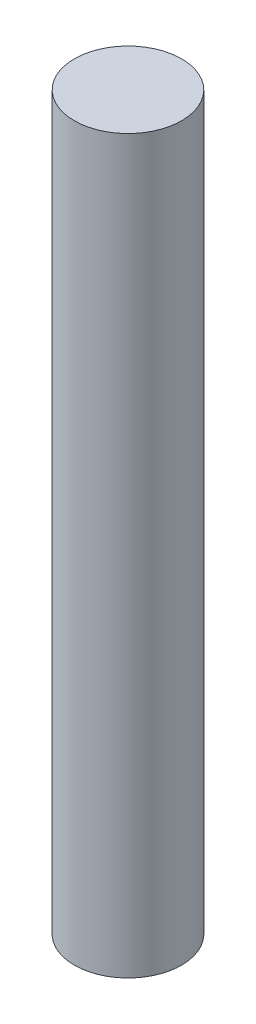
ISO-10303-21;
HEADER;
FILE_DESCRIPTION(('STEP AP214'),'2;1');
FILE_NAME('part.step','',(''),(''),'','','');
FILE_SCHEMA(('AUTOMOTIVE_DESIGN { 1 0 10303 214 1 1 1 1 }'));
ENDSEC;
DATA;
#1=APPLICATION_CONTEXT('core data for automotive mechanical design processes');
#2=APPLICATION_PROTOCOL_DEFINITION('international standard','automotive_design',2000,#1);
#3=PRODUCT_CONTEXT('',#1,'mechanical');
#4=PRODUCT('Part','Part','',(#3));
#5=PRODUCT_RELATED_PRODUCT_CATEGORY('part','',(#4));
#6=PRODUCT_DEFINITION_FORMATION('','',#4);
#7=PRODUCT_DEFINITION_CONTEXT('part definition',#1,'design');
#8=PRODUCT_DEFINITION('design','',#6,#7);
#9=PRODUCT_DEFINITION_SHAPE('','',#8);
#10=(LENGTH_UNIT() NAMED_UNIT(*) SI_UNIT(.MILLI.,.METRE.));
#11=(NAMED_UNIT(*) PLANE_ANGLE_UNIT() SI_UNIT($,.RADIAN.));
#12=(NAMED_UNIT(*) SI_UNIT($,.STERADIAN.) SOLID_ANGLE_UNIT());
#13=UNCERTAINTY_MEASURE_WITH_UNIT(LENGTH_MEASURE(1.E-05),#10,'distance_accuracy_value','');
#14=(GEOMETRIC_REPRESENTATION_CONTEXT(3) GLOBAL_UNCERTAINTY_ASSIGNED_CONTEXT((#13)) GLOBAL_UNIT_ASSIGNED_CONTEXT((#10,
#11,#12)) REPRESENTATION_CONTEXT('',''));
#15=CARTESIAN_POINT('',(0.,0.,0.));
#16=DIRECTION('',(0.,0.,1.));
#17=DIRECTION('',(1.,0.,0.));
#18=AXIS2_PLACEMENT_3D('',#15,#16,#17);
#19=CARTESIAN_POINT('',(0.,15.,0.));
#20=DIRECTION('',(0.,-1.,0.));
#21=DIRECTION('',(0.,0.,-1.));
#22=AXIS2_PLACEMENT_3D('',#19,#20,#21);
#23=CYLINDRICAL_SURFACE('',#22,1.1);
#24=CARTESIAN_POINT('',(0.,15.,0.));
#25=DIRECTION('',(0.,1.,0.));
#26=DIRECTION('',(0.,0.,1.));
#27=AXIS2_PLACEMENT_3D('',#24,#25,#26);
#28=CIRCLE('',#27,1.1);
#29=CARTESIAN_POINT('',(0.,15.,1.1));
#30=VERTEX_POINT('',#29);
#31=EDGE_CURVE('E10',#30,#30,#28,.T.);
#32=ORIENTED_EDGE('',*,*,#31,.F.);
#33=EDGE_LOOP('',(#32));
#34=FACE_BOUND('',#33,.T.);
#35=CARTESIAN_POINT('',(0.,0.,0.));
#36=DIRECTION('',(0.,1.,0.));
#37=DIRECTION('',(0.,0.,1.));
#38=AXIS2_PLACEMENT_3D('',#35,#36,#37);
#39=CIRCLE('',#38,1.1);
#40=CARTESIAN_POINT('',(0.,0.,1.1));
#41=VERTEX_POINT('',#40);
#42=EDGE_CURVE('E34',#41,#41,#39,.T.);
#43=ORIENTED_EDGE('',*,*,#42,.T.);
#44=EDGE_LOOP('',(#43));
#45=FACE_BOUND('',#44,.T.);
#46=ADVANCED_FACE('F31',(#34,#45),#23,.T.);
#47=CARTESIAN_POINT('',(0.,15.,0.));
#48=DIRECTION('',(0.,1.,0.));
#49=DIRECTION('',(0.,0.,1.));
#50=AXIS2_PLACEMENT_3D('',#47,#48,#49);
#51=PLANE('',#50);
#52=ORIENTED_EDGE('',*,*,#31,.T.);
#53=EDGE_LOOP('',(#52));
#54=FACE_BOUND('',#53,.T.);
#55=ADVANCED_FACE('F46',(#54),#51,.T.);
#56=CARTESIAN_POINT('',(0.,0.,0.));
#57=DIRECTION('',(0.,1.,0.));
#58=DIRECTION('',(0.,0.,1.));
#59=AXIS2_PLACEMENT_3D('',#56,#57,#58);
#60=PLANE('',#59);
#61=ORIENTED_EDGE('',*,*,#42,.F.);
#62=EDGE_LOOP('',(#61));
#63=FACE_BOUND('',#62,.T.);
#64=ADVANCED_FACE('F44',(#63),#60,.F.);
#65=CLOSED_SHELL('',(#46,#55,#64));
#66=MANIFOLD_SOLID_BREP('B2',#65);
#67=ADVANCED_BREP_SHAPE_REPRESENTATION('',(#18,#66),#14);
#68=SHAPE_DEFINITION_REPRESENTATION(#9,#67);
ENDSEC;
END-ISO-10303-21;
